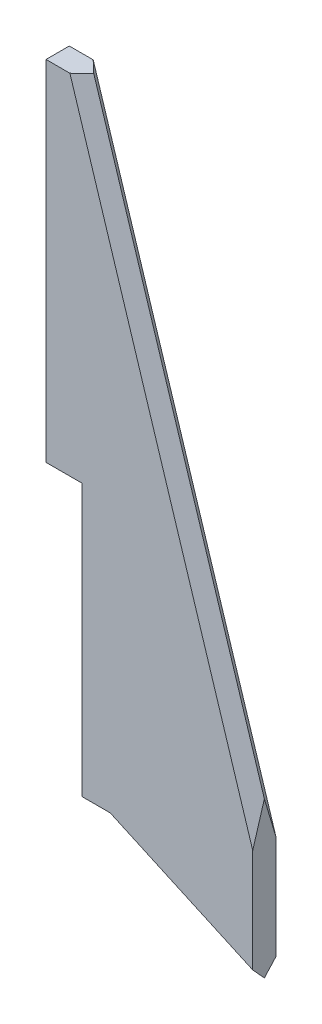
ISO-10303-21;
HEADER;
FILE_DESCRIPTION(('STEP AP214'),'2;1');
FILE_NAME('part.step','',(''),(''),'','','');
FILE_SCHEMA(('AUTOMOTIVE_DESIGN { 1 0 10303 214 1 1 1 1 }'));
ENDSEC;
DATA;
#1=APPLICATION_CONTEXT('core data for automotive mechanical design processes');
#2=APPLICATION_PROTOCOL_DEFINITION('international standard','automotive_design',2000,#1);
#3=PRODUCT_CONTEXT('',#1,'mechanical');
#4=PRODUCT('Part','Part','',(#3));
#5=PRODUCT_RELATED_PRODUCT_CATEGORY('part','',(#4));
#6=PRODUCT_DEFINITION_FORMATION('','',#4);
#7=PRODUCT_DEFINITION_CONTEXT('part definition',#1,'design');
#8=PRODUCT_DEFINITION('design','',#6,#7);
#9=PRODUCT_DEFINITION_SHAPE('','',#8);
#10=(LENGTH_UNIT() NAMED_UNIT(*) SI_UNIT(.MILLI.,.METRE.));
#11=(NAMED_UNIT(*) PLANE_ANGLE_UNIT() SI_UNIT($,.RADIAN.));
#12=(NAMED_UNIT(*) SI_UNIT($,.STERADIAN.) SOLID_ANGLE_UNIT());
#13=UNCERTAINTY_MEASURE_WITH_UNIT(LENGTH_MEASURE(1.E-05),#10,'distance_accuracy_value','');
#14=(GEOMETRIC_REPRESENTATION_CONTEXT(3) GLOBAL_UNCERTAINTY_ASSIGNED_CONTEXT((#13)) GLOBAL_UNIT_ASSIGNED_CONTEXT((#10,
#11,#12)) REPRESENTATION_CONTEXT('',''));
#15=CARTESIAN_POINT('',(0.,0.,0.));
#16=DIRECTION('',(0.,0.,1.));
#17=DIRECTION('',(1.,0.,0.));
#18=AXIS2_PLACEMENT_3D('',#15,#16,#17);
#19=CARTESIAN_POINT('',(-4.655,0.,-1.5));
#20=DIRECTION('',(0.,1.,0.));
#21=DIRECTION('',(0.,0.,1.));
#22=AXIS2_PLACEMENT_3D('',#19,#20,#21);
#23=PLANE('',#22);
#24=DIRECTION('',(1.,0.,0.));
#25=VECTOR('',#24,1.);
#26=CARTESIAN_POINT('',(-4.655,0.,1.5));
#27=LINE('',#26,#25);
#28=CARTESIAN_POINT('',(0.,0.,1.5));
#29=VERTEX_POINT('',#28);
#30=CARTESIAN_POINT('',(3.62491379207834,0.,1.5));
#31=VERTEX_POINT('',#30);
#32=EDGE_CURVE('E142',#29,#31,#27,.T.);
#33=ORIENTED_EDGE('',*,*,#32,.F.);
#34=DIRECTION('',(0.,0.,1.));
#35=VECTOR('',#34,1.);
#36=CARTESIAN_POINT('',(0.,0.,-1.5));
#37=LINE('',#36,#35);
#38=CARTESIAN_POINT('',(0.,0.,0.));
#39=VERTEX_POINT('',#38);
#40=EDGE_CURVE('E126',#39,#29,#37,.T.);
#41=ORIENTED_EDGE('',*,*,#40,.F.);
#42=DIRECTION('',(-0.924013619807977,0.,-0.382359556450939));
#43=VECTOR('',#42,1.);
#44=CARTESIAN_POINT('',(-4.50440260118104,0.,-1.86393505868664));
#45=LINE('',#44,#43);
#46=EDGE_CURVE('E55',#39,#31,#45,.F.);
#47=ORIENTED_EDGE('',*,*,#46,.T.);
#48=EDGE_LOOP('',(#33,#41,#47));
#49=FACE_BOUND('',#48,.T.);
#50=ADVANCED_FACE('F44',(#49),#23,.F.);
#51=CARTESIAN_POINT('',(22.,9.99999999999999,1.5));
#52=DIRECTION('',(-1.,0.,0.));
#53=DIRECTION('',(0.,-1.,0.));
#54=AXIS2_PLACEMENT_3D('',#51,#52,#53);
#55=PLANE('',#54);
#56=DIRECTION('',(0.,1.,0.));
#57=VECTOR('',#56,1.);
#58=CARTESIAN_POINT('',(22.,9.99999999999999,1.5));
#59=LINE('',#58,#57);
#60=CARTESIAN_POINT('',(22.,-8.35231191269167,1.5));
#61=VERTEX_POINT('',#60);
#62=CARTESIAN_POINT('',(22.,4.99710827422433,1.5));
#63=VERTEX_POINT('',#62);
#64=EDGE_CURVE('E163',#61,#63,#59,.T.);
#65=ORIENTED_EDGE('',*,*,#64,.F.);
#66=DIRECTION('',(0.,0.739470404682125,0.673189067498318));
#67=VECTOR('',#66,1.);
#68=CARTESIAN_POINT('',(22.,-3.03842502948086,6.33758448350339));
#69=LINE('',#68,#67);
#70=CARTESIAN_POINT('',(22.,-10.,0.));
#71=VERTEX_POINT('',#70);
#72=EDGE_CURVE('E185',#61,#71,#69,.F.);
#73=ORIENTED_EDGE('',*,*,#72,.T.);
#74=DIRECTION('',(0.,0.739470404682127,-0.673189067498315));
#75=VECTOR('',#74,1.);
#76=CARTESIAN_POINT('',(22.,-10.,0.));
#77=LINE('',#76,#75);
#78=CARTESIAN_POINT('',(22.,-8.35231191269166,-1.5));
#79=VERTEX_POINT('',#78);
#80=EDGE_CURVE('E182',#71,#79,#77,.T.);
#81=ORIENTED_EDGE('',*,*,#80,.T.);
#82=DIRECTION('',(0.,1.,0.));
#83=VECTOR('',#82,1.);
#84=CARTESIAN_POINT('',(22.,9.99999999999999,-1.5));
#85=LINE('',#84,#83);
#86=CARTESIAN_POINT('',(22.,4.99710827422432,-1.5));
#87=VERTEX_POINT('',#86);
#88=EDGE_CURVE('E162',#79,#87,#85,.T.);
#89=ORIENTED_EDGE('',*,*,#88,.T.);
#90=DIRECTION('',(0.,0.957871988179843,0.287195498328918));
#91=VECTOR('',#90,1.);
#92=CARTESIAN_POINT('',(22.,74.2263122017723,19.2567566086435));
#93=LINE('',#92,#91);
#94=CARTESIAN_POINT('',(22.,9.99999999999999,0.));
#95=VERTEX_POINT('',#94);
#96=EDGE_CURVE('E179',#87,#95,#93,.T.);
#97=ORIENTED_EDGE('',*,*,#96,.T.);
#98=DIRECTION('',(0.,0.957871988179843,-0.287195498328918));
#99=VECTOR('',#98,1.);
#100=CARTESIAN_POINT('',(22.,6.59802331449372,1.02000309180552));
#101=LINE('',#100,#99);
#102=EDGE_CURVE('E176',#95,#63,#101,.F.);
#103=ORIENTED_EDGE('',*,*,#102,.T.);
#104=EDGE_LOOP('',(#65,#73,#81,#89,#97,#103));
#105=FACE_BOUND('',#104,.T.);
#106=ADVANCED_FACE('F245',(#105),#55,.F.);
#107=CARTESIAN_POINT('',(0.,0.,1.5));
#108=DIRECTION('',(0.,0.,-1.));
#109=DIRECTION('',(-1.,0.,0.));
#110=AXIS2_PLACEMENT_3D('',#107,#108,#109);
#111=PLANE('',#110);
#112=DIRECTION('',(0.,1.,0.));
#113=VECTOR('',#112,1.);
#114=CARTESIAN_POINT('',(-4.655,0.,1.5));
#115=LINE('',#114,#113);
#116=CARTESIAN_POINT('',(-4.655,35.,1.5));
#117=VERTEX_POINT('',#116);
#118=CARTESIAN_POINT('',(-4.655,80.,1.5));
#119=VERTEX_POINT('',#118);
#120=EDGE_CURVE('E155',#117,#119,#115,.T.);
#121=ORIENTED_EDGE('',*,*,#120,.F.);
#122=DIRECTION('',(-1.,0.,0.));
#123=VECTOR('',#122,1.);
#124=CARTESIAN_POINT('',(-4.655,35.,1.5));
#125=LINE('',#124,#123);
#126=CARTESIAN_POINT('',(0.,35.,1.5));
#127=VERTEX_POINT('',#126);
#128=EDGE_CURVE('E63',#127,#117,#125,.T.);
#129=ORIENTED_EDGE('',*,*,#128,.F.);
#130=DIRECTION('',(0.,1.,0.));
#131=VECTOR('',#130,1.);
#132=CARTESIAN_POINT('',(0.,0.,1.5));
#133=LINE('',#132,#131);
#134=EDGE_CURVE('E129',#29,#127,#133,.T.);
#135=ORIENTED_EDGE('',*,*,#134,.F.);
#136=ORIENTED_EDGE('',*,*,#32,.T.);
#137=DIRECTION('',(0.910366477462605,-0.413802944301184,0.));
#138=VECTOR('',#137,1.);
#139=CARTESIAN_POINT('',(0.620704416451771,1.3655497161939,1.5));
#140=LINE('',#139,#138);
#141=EDGE_CURVE('E173',#31,#61,#140,.T.);
#142=ORIENTED_EDGE('',*,*,#141,.T.);
#143=ORIENTED_EDGE('',*,*,#64,.T.);
#144=DIRECTION('',(-0.299826596740395,0.953993716901256,0.));
#145=VECTOR('',#144,1.);
#146=CARTESIAN_POINT('',(21.4516245806659,6.74193915392358,1.5));
#147=LINE('',#146,#145);
#148=CARTESIAN_POINT('',(-1.5723373995295,80.,1.5));
#149=VERTEX_POINT('',#148);
#150=EDGE_CURVE('E167',#63,#149,#147,.T.);
#151=ORIENTED_EDGE('',*,*,#150,.T.);
#152=DIRECTION('',(1.,0.,0.));
#153=VECTOR('',#152,1.);
#154=CARTESIAN_POINT('',(-4.655,80.,1.5));
#155=LINE('',#154,#153);
#156=EDGE_CURVE('E149',#119,#149,#155,.T.);
#157=ORIENTED_EDGE('',*,*,#156,.F.);
#158=EDGE_LOOP('',(#121,#129,#135,#136,#142,#143,#151,#157));
#159=FACE_BOUND('',#158,.T.);
#160=ADVANCED_FACE('F140',(#159),#111,.F.);
#161=CARTESIAN_POINT('',(0.,0.,-1.5));
#162=DIRECTION('',(0.,0.,-1.));
#163=DIRECTION('',(-1.,0.,0.));
#164=AXIS2_PLACEMENT_3D('',#161,#162,#163);
#165=PLANE('',#164);
#166=DIRECTION('',(-1.,0.,0.));
#167=VECTOR('',#166,1.);
#168=CARTESIAN_POINT('',(-4.655,35.,-1.5));
#169=LINE('',#168,#167);
#170=CARTESIAN_POINT('',(0.,35.,-1.5));
#171=VERTEX_POINT('',#170);
#172=CARTESIAN_POINT('',(-4.655,35.,-1.5));
#173=VERTEX_POINT('',#172);
#174=EDGE_CURVE('E136',#171,#173,#169,.T.);
#175=ORIENTED_EDGE('',*,*,#174,.T.);
#176=DIRECTION('',(0.,-1.,0.));
#177=VECTOR('',#176,1.);
#178=CARTESIAN_POINT('',(-4.655,80.,-1.5));
#179=LINE('',#178,#177);
#180=CARTESIAN_POINT('',(-4.655,80.,-1.5));
#181=VERTEX_POINT('',#180);
#182=EDGE_CURVE('E211',#181,#173,#179,.T.);
#183=ORIENTED_EDGE('',*,*,#182,.F.);
#184=DIRECTION('',(1.,0.,0.));
#185=VECTOR('',#184,1.);
#186=CARTESIAN_POINT('',(-4.655,80.,-1.5));
#187=LINE('',#186,#185);
#188=CARTESIAN_POINT('',(-1.5723373995295,80.,-1.5));
#189=VERTEX_POINT('',#188);
#190=EDGE_CURVE('E153',#181,#189,#187,.T.);
#191=ORIENTED_EDGE('',*,*,#190,.T.);
#192=DIRECTION('',(0.299826596740395,-0.953993716901256,0.));
#193=VECTOR('',#192,1.);
#194=CARTESIAN_POINT('',(20.5690094246481,9.5502601048894,-1.5));
#195=LINE('',#194,#193);
#196=EDGE_CURVE('E188',#189,#87,#195,.T.);
#197=ORIENTED_EDGE('',*,*,#196,.T.);
#198=ORIENTED_EDGE('',*,*,#88,.F.);
#199=DIRECTION('',(-0.910366477462605,0.413802944301184,0.));
#200=VECTOR('',#199,1.);
#201=CARTESIAN_POINT('',(0.620704416451775,1.36554971619391,-1.5));
#202=LINE('',#201,#200);
#203=CARTESIAN_POINT('',(3.62491379207837,0.,-1.5));
#204=VERTEX_POINT('',#203);
#205=EDGE_CURVE('E192',#79,#204,#202,.T.);
#206=ORIENTED_EDGE('',*,*,#205,.T.);
#207=DIRECTION('',(1.,0.,0.));
#208=VECTOR('',#207,1.);
#209=CARTESIAN_POINT('',(-4.655,0.,-1.5));
#210=LINE('',#209,#208);
#211=CARTESIAN_POINT('',(0.,0.,-1.5));
#212=VERTEX_POINT('',#211);
#213=EDGE_CURVE('E148',#212,#204,#210,.T.);
#214=ORIENTED_EDGE('',*,*,#213,.F.);
#215=DIRECTION('',(0.,1.,0.));
#216=VECTOR('',#215,1.);
#217=CARTESIAN_POINT('',(0.,0.,-1.5));
#218=LINE('',#217,#216);
#219=EDGE_CURVE('E281',#212,#171,#218,.T.);
#220=ORIENTED_EDGE('',*,*,#219,.T.);
#221=EDGE_LOOP('',(#175,#183,#191,#197,#198,#206,#214,#220));
#222=FACE_BOUND('',#221,.T.);
#223=ADVANCED_FACE('F239',(#222),#165,.T.);
#224=CARTESIAN_POINT('',(-4.655,80.,1.5));
#225=DIRECTION('',(0.,-1.,0.));
#226=DIRECTION('',(0.,0.,-1.));
#227=AXIS2_PLACEMENT_3D('',#224,#225,#226);
#228=PLANE('',#227);
#229=DIRECTION('',(-0.72355490443209,0.,0.690266832661304));
#230=VECTOR('',#229,1.);
#231=CARTESIAN_POINT('',(10.4814365504289,80.,-9.99922461320835));
#232=LINE('',#231,#230);
#233=CARTESIAN_POINT('',(0.,80.,0.));
#234=VERTEX_POINT('',#233);
#235=EDGE_CURVE('E71',#149,#234,#232,.F.);
#236=ORIENTED_EDGE('',*,*,#235,.T.);
#237=DIRECTION('',(-0.72355490443209,0.,-0.690266832661304));
#238=VECTOR('',#237,1.);
#239=CARTESIAN_POINT('',(0.,80.,0.));
#240=LINE('',#239,#238);
#241=EDGE_CURVE('E198',#234,#189,#240,.T.);
#242=ORIENTED_EDGE('',*,*,#241,.T.);
#243=ORIENTED_EDGE('',*,*,#190,.F.);
#244=DIRECTION('',(0.,0.,-1.));
#245=VECTOR('',#244,1.);
#246=CARTESIAN_POINT('',(-4.655,80.,1.5));
#247=LINE('',#246,#245);
#248=EDGE_CURVE('E205',#119,#181,#247,.T.);
#249=ORIENTED_EDGE('',*,*,#248,.F.);
#250=ORIENTED_EDGE('',*,*,#156,.T.);
#251=EDGE_LOOP('',(#236,#242,#243,#249,#250));
#252=FACE_BOUND('',#251,.T.);
#253=ADVANCED_FACE('F235',(#252),#228,.F.);
#254=DIRECTION('',(-0.924013619807978,0.,0.382359556450936));
#255=VECTOR('',#254,1.);
#256=CARTESIAN_POINT('',(-3.44448628770784,0.,1.42533856745856));
#257=LINE('',#256,#255);
#258=EDGE_CURVE('E11',#204,#39,#257,.T.);
#259=ORIENTED_EDGE('',*,*,#258,.T.);
#260=EDGE_CURVE('E131',#212,#39,#37,.T.);
#261=ORIENTED_EDGE('',*,*,#260,.F.);
#262=ORIENTED_EDGE('',*,*,#213,.T.);
#263=EDGE_LOOP('',(#259,#261,#262));
#264=FACE_BOUND('',#263,.T.);
#265=ADVANCED_FACE('F259',(#264),#23,.F.);
#266=CARTESIAN_POINT('',(-4.655,0.,0.));
#267=DIRECTION('',(-1.,0.,0.));
#268=DIRECTION('',(0.,0.,1.));
#269=AXIS2_PLACEMENT_3D('',#266,#267,#268);
#270=PLANE('',#269);
#271=DIRECTION('',(0.,0.,1.));
#272=VECTOR('',#271,1.);
#273=CARTESIAN_POINT('',(-4.655,35.,-1.5));
#274=LINE('',#273,#272);
#275=EDGE_CURVE('E214',#173,#117,#274,.T.);
#276=ORIENTED_EDGE('',*,*,#275,.T.);
#277=ORIENTED_EDGE('',*,*,#120,.T.);
#278=ORIENTED_EDGE('',*,*,#248,.T.);
#279=ORIENTED_EDGE('',*,*,#182,.T.);
#280=EDGE_LOOP('',(#276,#277,#278,#279));
#281=FACE_BOUND('',#280,.T.);
#282=ADVANCED_FACE('F231',(#281),#270,.T.);
#283=CARTESIAN_POINT('',(22.,-10.,0.));
#284=DIRECTION('',(-0.292602867990326,-0.643726309578718,-0.707106781186547));
#285=DIRECTION('',(-0.910366477462605,0.413802944301184,0.));
#286=AXIS2_PLACEMENT_3D('',#283,#284,#285);
#287=PLANE('',#286);
#288=DIRECTION('',(0.910366477462605,-0.413802944301184,0.));
#289=VECTOR('',#288,1.);
#290=CARTESIAN_POINT('',(22.,-10.,0.));
#291=LINE('',#290,#289);
#292=EDGE_CURVE('E202',#39,#71,#291,.T.);
#293=ORIENTED_EDGE('',*,*,#292,.F.);
#294=ORIENTED_EDGE('',*,*,#258,.F.);
#295=ORIENTED_EDGE('',*,*,#205,.F.);
#296=ORIENTED_EDGE('',*,*,#80,.F.);
#297=EDGE_LOOP('',(#293,#294,#295,#296));
#298=FACE_BOUND('',#297,.T.);
#299=ADVANCED_FACE('F255',(#298),#287,.T.);
#300=CARTESIAN_POINT('',(0.620704416451772,1.3655497161939,1.5));
#301=DIRECTION('',(0.292602867990328,0.64372630957872,-0.707106781186545));
#302=DIRECTION('',(0.910366477462605,-0.413802944301184,0.));
#303=AXIS2_PLACEMENT_3D('',#300,#301,#302);
#304=PLANE('',#303);
#305=ORIENTED_EDGE('',*,*,#46,.F.);
#306=ORIENTED_EDGE('',*,*,#292,.T.);
#307=ORIENTED_EDGE('',*,*,#72,.F.);
#308=ORIENTED_EDGE('',*,*,#141,.F.);
#309=EDGE_LOOP('',(#305,#306,#307,#308));
#310=FACE_BOUND('',#309,.T.);
#311=ADVANCED_FACE('F248',(#310),#304,.F.);
#312=CARTESIAN_POINT('',(21.4516245806659,6.74193915392358,1.5));
#313=DIRECTION('',(-0.674575426430238,-0.212009419735218,-0.707106781186547));
#314=DIRECTION('',(-0.299826596740395,0.953993716901256,0.));
#315=AXIS2_PLACEMENT_3D('',#312,#313,#314);
#316=PLANE('',#315);
#317=ORIENTED_EDGE('',*,*,#150,.F.);
#318=ORIENTED_EDGE('',*,*,#102,.F.);
#319=DIRECTION('',(0.299826596740395,-0.953993716901256,0.));
#320=VECTOR('',#319,1.);
#321=CARTESIAN_POINT('',(0.,80.,0.));
#322=LINE('',#321,#320);
#323=EDGE_CURVE('E49',#234,#95,#322,.T.);
#324=ORIENTED_EDGE('',*,*,#323,.F.);
#325=ORIENTED_EDGE('',*,*,#235,.F.);
#326=EDGE_LOOP('',(#317,#318,#324,#325));
#327=FACE_BOUND('',#326,.T.);
#328=ADVANCED_FACE('F47',(#327),#316,.F.);
#329=CARTESIAN_POINT('',(0.,80.,0.));
#330=DIRECTION('',(0.674575426430238,0.212009419735218,-0.707106781186547));
#331=DIRECTION('',(0.299826596740395,-0.953993716901256,0.));
#332=AXIS2_PLACEMENT_3D('',#329,#330,#331);
#333=PLANE('',#332);
#334=ORIENTED_EDGE('',*,*,#96,.F.);
#335=ORIENTED_EDGE('',*,*,#196,.F.);
#336=ORIENTED_EDGE('',*,*,#241,.F.);
#337=ORIENTED_EDGE('',*,*,#323,.T.);
#338=EDGE_LOOP('',(#334,#335,#336,#337));
#339=FACE_BOUND('',#338,.T.);
#340=ADVANCED_FACE('F241',(#339),#333,.T.);
#341=CARTESIAN_POINT('',(-4.655,35.,-1.5));
#342=DIRECTION('',(0.,1.,0.));
#343=DIRECTION('',(0.,0.,1.));
#344=AXIS2_PLACEMENT_3D('',#341,#342,#343);
#345=PLANE('',#344);
#346=ORIENTED_EDGE('',*,*,#275,.F.);
#347=ORIENTED_EDGE('',*,*,#174,.F.);
#348=DIRECTION('',(0.,0.,1.));
#349=VECTOR('',#348,1.);
#350=CARTESIAN_POINT('',(0.,35.,-1.5));
#351=LINE('',#350,#349);
#352=EDGE_CURVE('E218',#171,#127,#351,.T.);
#353=ORIENTED_EDGE('',*,*,#352,.T.);
#354=ORIENTED_EDGE('',*,*,#128,.T.);
#355=EDGE_LOOP('',(#346,#347,#353,#354));
#356=FACE_BOUND('',#355,.T.);
#357=ADVANCED_FACE('F253',(#356),#345,.F.);
#358=CARTESIAN_POINT('',(0.,0.,-1.5));
#359=DIRECTION('',(1.,0.,0.));
#360=DIRECTION('',(0.,0.,-1.));
#361=AXIS2_PLACEMENT_3D('',#358,#359,#360);
#362=PLANE('',#361);
#363=ORIENTED_EDGE('',*,*,#352,.F.);
#364=ORIENTED_EDGE('',*,*,#219,.F.);
#365=ORIENTED_EDGE('',*,*,#260,.T.);
#366=ORIENTED_EDGE('',*,*,#40,.T.);
#367=ORIENTED_EDGE('',*,*,#134,.T.);
#368=EDGE_LOOP('',(#363,#364,#365,#366,#367));
#369=FACE_BOUND('',#368,.T.);
#370=ADVANCED_FACE('F128',(#369),#362,.F.);
#371=CLOSED_SHELL('',(#50,#106,#160,#223,#253,#265,#282,#299,#311,#328,#340,#357,#370));
#372=MANIFOLD_SOLID_BREP('B2',#371);
#373=ADVANCED_BREP_SHAPE_REPRESENTATION('',(#18,#372),#14);
#374=SHAPE_DEFINITION_REPRESENTATION(#9,#373);
ENDSEC;
END-ISO-10303-21;
